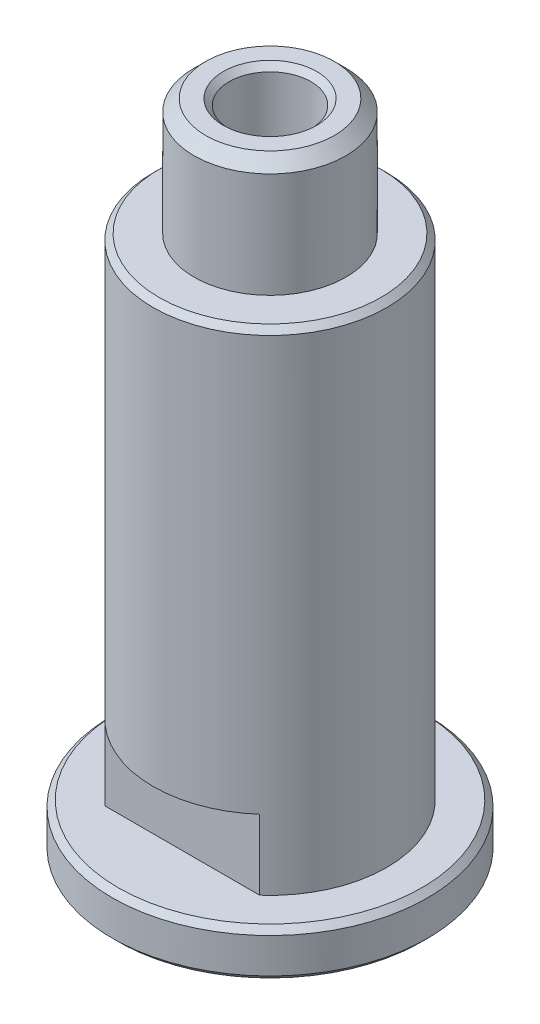
ISO-10303-21;
HEADER;
FILE_DESCRIPTION(('STEP AP214'),'2;1');
FILE_NAME('part.step','',(''),(''),'','','');
FILE_SCHEMA(('AUTOMOTIVE_DESIGN { 1 0 10303 214 1 1 1 1 }'));
ENDSEC;
DATA;
#1=APPLICATION_CONTEXT('core data for automotive mechanical design processes');
#2=APPLICATION_PROTOCOL_DEFINITION('international standard','automotive_design',2000,#1);
#3=PRODUCT_CONTEXT('',#1,'mechanical');
#4=PRODUCT('Part','Part','',(#3));
#5=PRODUCT_RELATED_PRODUCT_CATEGORY('part','',(#4));
#6=PRODUCT_DEFINITION_FORMATION('','',#4);
#7=PRODUCT_DEFINITION_CONTEXT('part definition',#1,'design');
#8=PRODUCT_DEFINITION('design','',#6,#7);
#9=PRODUCT_DEFINITION_SHAPE('','',#8);
#10=(LENGTH_UNIT() NAMED_UNIT(*) SI_UNIT(.MILLI.,.METRE.));
#11=(NAMED_UNIT(*) PLANE_ANGLE_UNIT() SI_UNIT($,.RADIAN.));
#12=(NAMED_UNIT(*) SI_UNIT($,.STERADIAN.) SOLID_ANGLE_UNIT());
#13=UNCERTAINTY_MEASURE_WITH_UNIT(LENGTH_MEASURE(1.E-05),#10,'distance_accuracy_value','');
#14=(GEOMETRIC_REPRESENTATION_CONTEXT(3) GLOBAL_UNCERTAINTY_ASSIGNED_CONTEXT((#13)) GLOBAL_UNIT_ASSIGNED_CONTEXT((#10,
#11,#12)) REPRESENTATION_CONTEXT('',''));
#15=CARTESIAN_POINT('',(0.,0.,0.));
#16=DIRECTION('',(0.,0.,1.));
#17=DIRECTION('',(1.,0.,0.));
#18=AXIS2_PLACEMENT_3D('',#15,#16,#17);
#19=CARTESIAN_POINT('',(6.25,-5.,0.));
#20=DIRECTION('',(0.,-1.,0.));
#21=DIRECTION('',(0.,0.,-1.));
#22=AXIS2_PLACEMENT_3D('',#19,#20,#21);
#23=PLANE('',#22);
#24=CARTESIAN_POINT('',(0.,-5.,0.));
#25=DIRECTION('',(0.,-1.,0.));
#26=DIRECTION('',(0.,0.,-1.));
#27=AXIS2_PLACEMENT_3D('',#24,#25,#26);
#28=CIRCLE('',#27,4.);
#29=CARTESIAN_POINT('',(0.,-5.,-4.));
#30=VERTEX_POINT('',#29);
#31=EDGE_CURVE('E126',#30,#30,#28,.F.);
#32=ORIENTED_EDGE('',*,*,#31,.T.);
#33=EDGE_LOOP('',(#32));
#34=FACE_BOUND('',#33,.T.);
#35=CARTESIAN_POINT('',(0.,-5.,0.));
#36=DIRECTION('',(0.,-1.,0.));
#37=DIRECTION('',(0.,0.,-1.));
#38=AXIS2_PLACEMENT_3D('',#35,#36,#37);
#39=CIRCLE('',#38,5.74999999999999);
#40=CARTESIAN_POINT('',(0.,-5.,-5.74999999999999));
#41=VERTEX_POINT('',#40);
#42=EDGE_CURVE('E123',#41,#41,#39,.T.);
#43=ORIENTED_EDGE('',*,*,#42,.T.);
#44=EDGE_LOOP('',(#43));
#45=FACE_BOUND('',#44,.T.);
#46=ADVANCED_FACE('F37',(#34,#45),#23,.T.);
#47=CARTESIAN_POINT('',(0.,0.,0.));
#48=DIRECTION('',(0.,-1.,0.));
#49=DIRECTION('',(0.,0.,-1.));
#50=AXIS2_PLACEMENT_3D('',#47,#48,#49);
#51=CYLINDRICAL_SURFACE('',#50,3.5);
#52=CARTESIAN_POINT('',(0.,-4.5,0.));
#53=DIRECTION('',(0.,-1.,0.));
#54=DIRECTION('',(0.,0.,-1.));
#55=AXIS2_PLACEMENT_3D('',#52,#53,#54);
#56=CIRCLE('',#55,3.5);
#57=CARTESIAN_POINT('',(0.,-4.5,-3.5));
#58=VERTEX_POINT('',#57);
#59=EDGE_CURVE('E120',#58,#58,#56,.T.);
#60=ORIENTED_EDGE('',*,*,#59,.T.);
#61=EDGE_LOOP('',(#60));
#62=FACE_BOUND('',#61,.T.);
#63=CARTESIAN_POINT('',(0.,55.5,0.));
#64=DIRECTION('',(0.,1.,0.));
#65=DIRECTION('',(0.,0.,1.));
#66=AXIS2_PLACEMENT_3D('',#63,#64,#65);
#67=CIRCLE('',#66,3.5);
#68=CARTESIAN_POINT('',(0.,55.5,3.5));
#69=VERTEX_POINT('',#68);
#70=EDGE_CURVE('E117',#69,#69,#67,.T.);
#71=ORIENTED_EDGE('',*,*,#70,.T.);
#72=EDGE_LOOP('',(#71));
#73=FACE_BOUND('',#72,.T.);
#74=ADVANCED_FACE('F174',(#62,#73),#51,.F.);
#75=CARTESIAN_POINT('',(3.5,56.,0.));
#76=DIRECTION('',(0.,1.,0.));
#77=DIRECTION('',(0.,0.,1.));
#78=AXIS2_PLACEMENT_3D('',#75,#76,#77);
#79=PLANE('',#78);
#80=CARTESIAN_POINT('',(0.,56.,0.));
#81=DIRECTION('',(0.,1.,0.));
#82=DIRECTION('',(0.,0.,1.));
#83=AXIS2_PLACEMENT_3D('',#80,#81,#82);
#84=CIRCLE('',#83,4.00000000000001);
#85=CARTESIAN_POINT('',(0.,56.,4.00000000000001));
#86=VERTEX_POINT('',#85);
#87=EDGE_CURVE('E149',#86,#86,#84,.F.);
#88=ORIENTED_EDGE('',*,*,#87,.T.);
#89=EDGE_LOOP('',(#88));
#90=FACE_BOUND('',#89,.T.);
#91=CARTESIAN_POINT('',(0.,56.,0.));
#92=DIRECTION('',(0.,1.,0.));
#93=DIRECTION('',(0.,0.,1.));
#94=AXIS2_PLACEMENT_3D('',#91,#92,#93);
#95=CIRCLE('',#94,5.49999999999997);
#96=CARTESIAN_POINT('',(0.,56.,5.49999999999997));
#97=VERTEX_POINT('',#96);
#98=EDGE_CURVE('E114',#97,#97,#95,.T.);
#99=ORIENTED_EDGE('',*,*,#98,.T.);
#100=EDGE_LOOP('',(#99));
#101=FACE_BOUND('',#100,.T.);
#102=ADVANCED_FACE('F180',(#90,#101),#79,.T.);
#103=CARTESIAN_POINT('',(0.,0.,0.));
#104=DIRECTION('',(0.,-1.,0.));
#105=DIRECTION('',(0.,0.,-1.));
#106=AXIS2_PLACEMENT_3D('',#103,#104,#105);
#107=CYLINDRICAL_SURFACE('',#106,6.5);
#108=CARTESIAN_POINT('',(0.,55.,0.));
#109=DIRECTION('',(0.,1.,0.));
#110=DIRECTION('',(0.,0.,1.));
#111=AXIS2_PLACEMENT_3D('',#108,#109,#110);
#112=CIRCLE('',#111,6.5);
#113=CARTESIAN_POINT('',(0.,55.,6.5));
#114=VERTEX_POINT('',#113);
#115=EDGE_CURVE('E111',#114,#114,#112,.F.);
#116=ORIENTED_EDGE('',*,*,#115,.T.);
#117=EDGE_LOOP('',(#116));
#118=FACE_BOUND('',#117,.T.);
#119=CARTESIAN_POINT('',(0.,46.,0.));
#120=DIRECTION('',(0.,-1.,0.));
#121=DIRECTION('',(0.,0.,-1.));
#122=AXIS2_PLACEMENT_3D('',#119,#120,#121);
#123=CIRCLE('',#122,6.5);
#124=CARTESIAN_POINT('',(0.,46.,-6.5));
#125=VERTEX_POINT('',#124);
#126=EDGE_CURVE('E104',#125,#125,#123,.T.);
#127=ORIENTED_EDGE('',*,*,#126,.F.);
#128=EDGE_LOOP('',(#127));
#129=FACE_BOUND('',#128,.T.);
#130=ADVANCED_FACE('F243',(#118,#129),#107,.T.);
#131=CARTESIAN_POINT('',(6.5,46.,0.));
#132=DIRECTION('',(0.,1.,0.));
#133=DIRECTION('',(0.,0.,1.));
#134=AXIS2_PLACEMENT_3D('',#131,#132,#133);
#135=PLANE('',#134);
#136=CARTESIAN_POINT('',(0.,46.,0.));
#137=DIRECTION('',(0.,1.,0.));
#138=DIRECTION('',(0.,0.,1.));
#139=AXIS2_PLACEMENT_3D('',#136,#137,#138);
#140=CIRCLE('',#139,9.49999999999999);
#141=CARTESIAN_POINT('',(0.,46.,9.49999999999999));
#142=VERTEX_POINT('',#141);
#143=EDGE_CURVE('E147',#142,#142,#140,.T.);
#144=ORIENTED_EDGE('',*,*,#143,.T.);
#145=EDGE_LOOP('',(#144));
#146=FACE_BOUND('',#145,.T.);
#147=ORIENTED_EDGE('',*,*,#126,.T.);
#148=EDGE_LOOP('',(#147));
#149=FACE_BOUND('',#148,.T.);
#150=ADVANCED_FACE('F235',(#146,#149),#135,.T.);
#151=CARTESIAN_POINT('',(0.,0.,0.));
#152=DIRECTION('',(0.,-1.,0.));
#153=DIRECTION('',(0.,0.,-1.));
#154=AXIS2_PLACEMENT_3D('',#151,#152,#153);
#155=CYLINDRICAL_SURFACE('',#154,10.);
#156=DIRECTION('',(0.,-1.,0.));
#157=VECTOR('',#156,1.);
#158=CARTESIAN_POINT('',(-6.61437827766148,0.,-7.5));
#159=LINE('',#158,#157);
#160=CARTESIAN_POINT('',(-6.61437827766148,4.,-7.5));
#161=VERTEX_POINT('',#160);
#162=CARTESIAN_POINT('',(-6.61437827766148,10.,-7.5));
#163=VERTEX_POINT('',#162);
#164=EDGE_CURVE('E101',#161,#163,#159,.F.);
#165=ORIENTED_EDGE('',*,*,#164,.F.);
#166=CARTESIAN_POINT('',(0.,4.,0.));
#167=DIRECTION('',(0.,-1.,0.));
#168=DIRECTION('',(0.,0.,-1.));
#169=AXIS2_PLACEMENT_3D('',#166,#167,#168);
#170=CIRCLE('',#169,10.);
#171=CARTESIAN_POINT('',(-6.61437827766148,4.,7.5));
#172=VERTEX_POINT('',#171);
#173=EDGE_CURVE('E92',#172,#161,#170,.T.);
#174=ORIENTED_EDGE('',*,*,#173,.F.);
#175=DIRECTION('',(0.,-1.,0.));
#176=VECTOR('',#175,1.);
#177=CARTESIAN_POINT('',(-6.61437827766148,0.,7.5));
#178=LINE('',#177,#176);
#179=CARTESIAN_POINT('',(-6.61437827766148,10.,7.5));
#180=VERTEX_POINT('',#179);
#181=EDGE_CURVE('E76',#180,#172,#178,.T.);
#182=ORIENTED_EDGE('',*,*,#181,.F.);
#183=CARTESIAN_POINT('',(0.,10.,0.));
#184=DIRECTION('',(0.,1.,0.));
#185=DIRECTION('',(0.,0.,1.));
#186=AXIS2_PLACEMENT_3D('',#183,#184,#185);
#187=CIRCLE('',#186,10.);
#188=CARTESIAN_POINT('',(6.61437827766148,10.,7.5));
#189=VERTEX_POINT('',#188);
#190=EDGE_CURVE('E42',#189,#180,#187,.F.);
#191=ORIENTED_EDGE('',*,*,#190,.F.);
#192=DIRECTION('',(0.,-1.,0.));
#193=VECTOR('',#192,1.);
#194=CARTESIAN_POINT('',(6.61437827766148,0.,7.5));
#195=LINE('',#194,#193);
#196=CARTESIAN_POINT('',(6.61437827766148,4.,7.5));
#197=VERTEX_POINT('',#196);
#198=EDGE_CURVE('E84',#197,#189,#195,.F.);
#199=ORIENTED_EDGE('',*,*,#198,.F.);
#200=CARTESIAN_POINT('',(6.61437827766148,4.,-7.5));
#201=VERTEX_POINT('',#200);
#202=EDGE_CURVE('E94',#201,#197,#170,.T.);
#203=ORIENTED_EDGE('',*,*,#202,.F.);
#204=DIRECTION('',(0.,-1.,0.));
#205=VECTOR('',#204,1.);
#206=CARTESIAN_POINT('',(6.61437827766148,0.,-7.5));
#207=LINE('',#206,#205);
#208=CARTESIAN_POINT('',(6.61437827766148,10.,-7.5));
#209=VERTEX_POINT('',#208);
#210=EDGE_CURVE('E156',#209,#201,#207,.T.);
#211=ORIENTED_EDGE('',*,*,#210,.F.);
#212=EDGE_CURVE('E12',#163,#209,#187,.F.);
#213=ORIENTED_EDGE('',*,*,#212,.F.);
#214=EDGE_LOOP('',(#165,#174,#182,#191,#199,#203,#211,#213));
#215=FACE_BOUND('',#214,.T.);
#216=CARTESIAN_POINT('',(0.,45.5,0.));
#217=DIRECTION('',(0.,1.,0.));
#218=DIRECTION('',(0.,0.,1.));
#219=AXIS2_PLACEMENT_3D('',#216,#217,#218);
#220=CIRCLE('',#219,10.);
#221=CARTESIAN_POINT('',(0.,45.5,10.));
#222=VERTEX_POINT('',#221);
#223=EDGE_CURVE('E144',#222,#222,#220,.F.);
#224=ORIENTED_EDGE('',*,*,#223,.T.);
#225=EDGE_LOOP('',(#224));
#226=FACE_BOUND('',#225,.T.);
#227=ADVANCED_FACE('F98',(#215,#226),#155,.T.);
#228=CARTESIAN_POINT('',(10.,4.,0.));
#229=DIRECTION('',(0.,1.,0.));
#230=DIRECTION('',(0.,0.,1.));
#231=AXIS2_PLACEMENT_3D('',#228,#229,#230);
#232=PLANE('',#231);
#233=ORIENTED_EDGE('',*,*,#173,.T.);
#234=DIRECTION('',(-1.,0.,0.));
#235=VECTOR('',#234,1.);
#236=CARTESIAN_POINT('',(-16.8307601110123,4.,-7.5));
#237=LINE('',#236,#235);
#238=EDGE_CURVE('E95',#201,#161,#237,.T.);
#239=ORIENTED_EDGE('',*,*,#238,.F.);
#240=ORIENTED_EDGE('',*,*,#202,.T.);
#241=DIRECTION('',(1.,0.,0.));
#242=VECTOR('',#241,1.);
#243=CARTESIAN_POINT('',(-16.8307601110123,4.,7.5));
#244=LINE('',#243,#242);
#245=EDGE_CURVE('E79',#172,#197,#244,.T.);
#246=ORIENTED_EDGE('',*,*,#245,.F.);
#247=EDGE_LOOP('',(#233,#239,#240,#246));
#248=FACE_BOUND('',#247,.T.);
#249=CARTESIAN_POINT('',(0.,4.,0.));
#250=DIRECTION('',(0.,1.,0.));
#251=DIRECTION('',(0.,0.,1.));
#252=AXIS2_PLACEMENT_3D('',#249,#250,#251);
#253=CIRCLE('',#252,13.);
#254=CARTESIAN_POINT('',(0.,4.,13.));
#255=VERTEX_POINT('',#254);
#256=EDGE_CURVE('E141',#255,#255,#253,.T.);
#257=ORIENTED_EDGE('',*,*,#256,.T.);
#258=EDGE_LOOP('',(#257));
#259=FACE_BOUND('',#258,.T.);
#260=ADVANCED_FACE('F89',(#248,#259),#232,.T.);
#261=CARTESIAN_POINT('',(0.,0.,0.));
#262=DIRECTION('',(0.,-1.,0.));
#263=DIRECTION('',(0.,0.,-1.));
#264=AXIS2_PLACEMENT_3D('',#261,#262,#263);
#265=CYLINDRICAL_SURFACE('',#264,13.5);
#266=CARTESIAN_POINT('',(0.,0.500000000000006,0.));
#267=DIRECTION('',(0.,-1.,0.));
#268=DIRECTION('',(0.,0.,-1.));
#269=AXIS2_PLACEMENT_3D('',#266,#267,#268);
#270=CIRCLE('',#269,13.5);
#271=CARTESIAN_POINT('',(0.,0.500000000000006,-13.5));
#272=VERTEX_POINT('',#271);
#273=EDGE_CURVE('E138',#272,#272,#270,.F.);
#274=ORIENTED_EDGE('',*,*,#273,.T.);
#275=EDGE_LOOP('',(#274));
#276=FACE_BOUND('',#275,.T.);
#277=CARTESIAN_POINT('',(0.,3.49999999999998,0.));
#278=DIRECTION('',(0.,1.,0.));
#279=DIRECTION('',(0.,0.,1.));
#280=AXIS2_PLACEMENT_3D('',#277,#278,#279);
#281=CIRCLE('',#280,13.5);
#282=CARTESIAN_POINT('',(0.,3.49999999999998,13.5));
#283=VERTEX_POINT('',#282);
#284=EDGE_CURVE('E135',#283,#283,#281,.F.);
#285=ORIENTED_EDGE('',*,*,#284,.T.);
#286=EDGE_LOOP('',(#285));
#287=FACE_BOUND('',#286,.T.);
#288=ADVANCED_FACE('F241',(#276,#287),#265,.T.);
#289=CARTESIAN_POINT('',(13.5,0.,0.));
#290=DIRECTION('',(0.,-1.,0.));
#291=DIRECTION('',(0.,0.,-1.));
#292=AXIS2_PLACEMENT_3D('',#289,#290,#291);
#293=PLANE('',#292);
#294=CARTESIAN_POINT('',(0.,0.,0.));
#295=DIRECTION('',(0.,-1.,0.));
#296=DIRECTION('',(0.,0.,-1.));
#297=AXIS2_PLACEMENT_3D('',#294,#295,#296);
#298=CIRCLE('',#297,13.);
#299=CARTESIAN_POINT('',(0.,0.,-13.));
#300=VERTEX_POINT('',#299);
#301=EDGE_CURVE('E132',#300,#300,#298,.T.);
#302=ORIENTED_EDGE('',*,*,#301,.T.);
#303=EDGE_LOOP('',(#302));
#304=FACE_BOUND('',#303,.T.);
#305=CARTESIAN_POINT('',(0.,0.,0.));
#306=DIRECTION('',(0.,-1.,0.));
#307=DIRECTION('',(0.,0.,-1.));
#308=AXIS2_PLACEMENT_3D('',#305,#306,#307);
#309=CIRCLE('',#308,6.25);
#310=CARTESIAN_POINT('',(0.,0.,-6.25));
#311=VERTEX_POINT('',#310);
#312=EDGE_CURVE('E102',#311,#311,#309,.T.);
#313=ORIENTED_EDGE('',*,*,#312,.F.);
#314=EDGE_LOOP('',(#313));
#315=FACE_BOUND('',#314,.T.);
#316=ADVANCED_FACE('F281',(#304,#315),#293,.T.);
#317=CARTESIAN_POINT('',(0.,0.,0.));
#318=DIRECTION('',(0.,-1.,0.));
#319=DIRECTION('',(0.,0.,-1.));
#320=AXIS2_PLACEMENT_3D('',#317,#318,#319);
#321=CYLINDRICAL_SURFACE('',#320,6.25);
#322=CARTESIAN_POINT('',(0.,-4.49999999999998,0.));
#323=DIRECTION('',(0.,-1.,0.));
#324=DIRECTION('',(0.,0.,-1.));
#325=AXIS2_PLACEMENT_3D('',#322,#323,#324);
#326=CIRCLE('',#325,6.25);
#327=CARTESIAN_POINT('',(0.,-4.49999999999998,-6.25));
#328=VERTEX_POINT('',#327);
#329=EDGE_CURVE('E129',#328,#328,#326,.F.);
#330=ORIENTED_EDGE('',*,*,#329,.T.);
#331=EDGE_LOOP('',(#330));
#332=FACE_BOUND('',#331,.T.);
#333=ORIENTED_EDGE('',*,*,#312,.T.);
#334=EDGE_LOOP('',(#333));
#335=FACE_BOUND('',#334,.T.);
#336=ADVANCED_FACE('F194',(#332,#335),#321,.T.);
#337=CARTESIAN_POINT('',(0.,55.,0.));
#338=DIRECTION('',(0.,-1.,0.));
#339=DIRECTION('',(0.,0.,-1.));
#340=AXIS2_PLACEMENT_3D('',#337,#338,#339);
#341=CONICAL_SURFACE('',#340,6.5,0.785398163397449);
#342=ORIENTED_EDGE('',*,*,#98,.F.);
#343=EDGE_LOOP('',(#342));
#344=FACE_BOUND('',#343,.T.);
#345=ORIENTED_EDGE('',*,*,#115,.F.);
#346=EDGE_LOOP('',(#345));
#347=FACE_BOUND('',#346,.T.);
#348=ADVANCED_FACE('F187',(#344,#347),#341,.T.);
#349=CARTESIAN_POINT('',(0.,-4.5,0.));
#350=DIRECTION('',(0.,-1.,0.));
#351=DIRECTION('',(0.,0.,-1.));
#352=AXIS2_PLACEMENT_3D('',#349,#350,#351);
#353=CONICAL_SURFACE('',#352,3.5,0.78539816339745);
#354=ORIENTED_EDGE('',*,*,#31,.F.);
#355=EDGE_LOOP('',(#354));
#356=FACE_BOUND('',#355,.T.);
#357=ORIENTED_EDGE('',*,*,#59,.F.);
#358=EDGE_LOOP('',(#357));
#359=FACE_BOUND('',#358,.T.);
#360=ADVANCED_FACE('F193',(#356,#359),#353,.F.);
#361=CARTESIAN_POINT('',(0.,-5.,0.));
#362=DIRECTION('',(0.,1.,0.));
#363=DIRECTION('',(0.,0.,1.));
#364=AXIS2_PLACEMENT_3D('',#361,#362,#363);
#365=CONICAL_SURFACE('',#364,5.74999999999999,0.785398163397441);
#366=ORIENTED_EDGE('',*,*,#329,.F.);
#367=EDGE_LOOP('',(#366));
#368=FACE_BOUND('',#367,.T.);
#369=ORIENTED_EDGE('',*,*,#42,.F.);
#370=EDGE_LOOP('',(#369));
#371=FACE_BOUND('',#370,.T.);
#372=ADVANCED_FACE('F201',(#368,#371),#365,.T.);
#373=CARTESIAN_POINT('',(0.,0.,0.));
#374=DIRECTION('',(0.,1.,0.));
#375=DIRECTION('',(0.,0.,1.));
#376=AXIS2_PLACEMENT_3D('',#373,#374,#375);
#377=CONICAL_SURFACE('',#376,13.,0.785398163397443);
#378=ORIENTED_EDGE('',*,*,#273,.F.);
#379=EDGE_LOOP('',(#378));
#380=FACE_BOUND('',#379,.T.);
#381=ORIENTED_EDGE('',*,*,#301,.F.);
#382=EDGE_LOOP('',(#381));
#383=FACE_BOUND('',#382,.T.);
#384=ADVANCED_FACE('F208',(#380,#383),#377,.T.);
#385=CARTESIAN_POINT('',(0.,3.49999999999998,0.));
#386=DIRECTION('',(0.,-1.,0.));
#387=DIRECTION('',(0.,0.,-1.));
#388=AXIS2_PLACEMENT_3D('',#385,#386,#387);
#389=CONICAL_SURFACE('',#388,13.5,0.785398163397447);
#390=ORIENTED_EDGE('',*,*,#256,.F.);
#391=EDGE_LOOP('',(#390));
#392=FACE_BOUND('',#391,.T.);
#393=ORIENTED_EDGE('',*,*,#284,.F.);
#394=EDGE_LOOP('',(#393));
#395=FACE_BOUND('',#394,.T.);
#396=ADVANCED_FACE('F215',(#392,#395),#389,.T.);
#397=CARTESIAN_POINT('',(0.,45.5,0.));
#398=DIRECTION('',(0.,-1.,0.));
#399=DIRECTION('',(0.,0.,-1.));
#400=AXIS2_PLACEMENT_3D('',#397,#398,#399);
#401=CONICAL_SURFACE('',#400,10.,0.785398163397448);
#402=ORIENTED_EDGE('',*,*,#143,.F.);
#403=EDGE_LOOP('',(#402));
#404=FACE_BOUND('',#403,.T.);
#405=ORIENTED_EDGE('',*,*,#223,.F.);
#406=EDGE_LOOP('',(#405));
#407=FACE_BOUND('',#406,.T.);
#408=ADVANCED_FACE('F221',(#404,#407),#401,.T.);
#409=CARTESIAN_POINT('',(0.,56.,0.));
#410=DIRECTION('',(0.,1.,0.));
#411=DIRECTION('',(0.,0.,1.));
#412=AXIS2_PLACEMENT_3D('',#409,#410,#411);
#413=CONICAL_SURFACE('',#412,4.00000000000001,0.785398163397444);
#414=ORIENTED_EDGE('',*,*,#70,.F.);
#415=EDGE_LOOP('',(#414));
#416=FACE_BOUND('',#415,.T.);
#417=ORIENTED_EDGE('',*,*,#87,.F.);
#418=EDGE_LOOP('',(#417));
#419=FACE_BOUND('',#418,.T.);
#420=ADVANCED_FACE('F40',(#416,#419),#413,.F.);
#421=CARTESIAN_POINT('',(-16.8307601110123,10.,7.5));
#422=DIRECTION('',(0.,0.,-1.));
#423=DIRECTION('',(-1.,0.,0.));
#424=AXIS2_PLACEMENT_3D('',#421,#422,#423);
#425=PLANE('',#424);
#426=ORIENTED_EDGE('',*,*,#198,.T.);
#427=DIRECTION('',(1.,0.,0.));
#428=VECTOR('',#427,1.);
#429=CARTESIAN_POINT('',(-16.8307601110123,10.,7.5));
#430=LINE('',#429,#428);
#431=EDGE_CURVE('E60',#180,#189,#430,.T.);
#432=ORIENTED_EDGE('',*,*,#431,.F.);
#433=ORIENTED_EDGE('',*,*,#181,.T.);
#434=ORIENTED_EDGE('',*,*,#245,.T.);
#435=EDGE_LOOP('',(#426,#432,#433,#434));
#436=FACE_BOUND('',#435,.T.);
#437=ADVANCED_FACE('F78',(#436),#425,.F.);
#438=CARTESIAN_POINT('',(0.,10.,0.));
#439=DIRECTION('',(0.,1.,0.));
#440=DIRECTION('',(0.,0.,1.));
#441=AXIS2_PLACEMENT_3D('',#438,#439,#440);
#442=PLANE('',#441);
#443=ORIENTED_EDGE('',*,*,#190,.T.);
#444=ORIENTED_EDGE('',*,*,#431,.T.);
#445=EDGE_LOOP('',(#443,#444));
#446=FACE_BOUND('',#445,.T.);
#447=ADVANCED_FACE('F154',(#446),#442,.F.);
#448=ORIENTED_EDGE('',*,*,#212,.T.);
#449=DIRECTION('',(-1.,0.,0.));
#450=VECTOR('',#449,1.);
#451=CARTESIAN_POINT('',(-16.8307601110123,10.,-7.5));
#452=LINE('',#451,#450);
#453=EDGE_CURVE('E53',#209,#163,#452,.T.);
#454=ORIENTED_EDGE('',*,*,#453,.T.);
#455=EDGE_LOOP('',(#448,#454));
#456=FACE_BOUND('',#455,.T.);
#457=ADVANCED_FACE('F161',(#456),#442,.F.);
#458=CARTESIAN_POINT('',(-16.8307601110123,10.,-7.5));
#459=DIRECTION('',(0.,0.,1.));
#460=DIRECTION('',(1.,0.,0.));
#461=AXIS2_PLACEMENT_3D('',#458,#459,#460);
#462=PLANE('',#461);
#463=ORIENTED_EDGE('',*,*,#164,.T.);
#464=ORIENTED_EDGE('',*,*,#453,.F.);
#465=ORIENTED_EDGE('',*,*,#210,.T.);
#466=ORIENTED_EDGE('',*,*,#238,.T.);
#467=EDGE_LOOP('',(#463,#464,#465,#466));
#468=FACE_BOUND('',#467,.T.);
#469=ADVANCED_FACE('F159',(#468),#462,.F.);
#470=CLOSED_SHELL('',(#46,#74,#102,#130,#150,#227,#260,#288,#316,#336,#348,#360,#372,#384,#396,
#408,#420,#437,#447,#457,#469));
#471=MANIFOLD_SOLID_BREP('B2',#470);
#472=ADVANCED_BREP_SHAPE_REPRESENTATION('',(#18,#471),#14);
#473=SHAPE_DEFINITION_REPRESENTATION(#9,#472);
ENDSEC;
END-ISO-10303-21;
